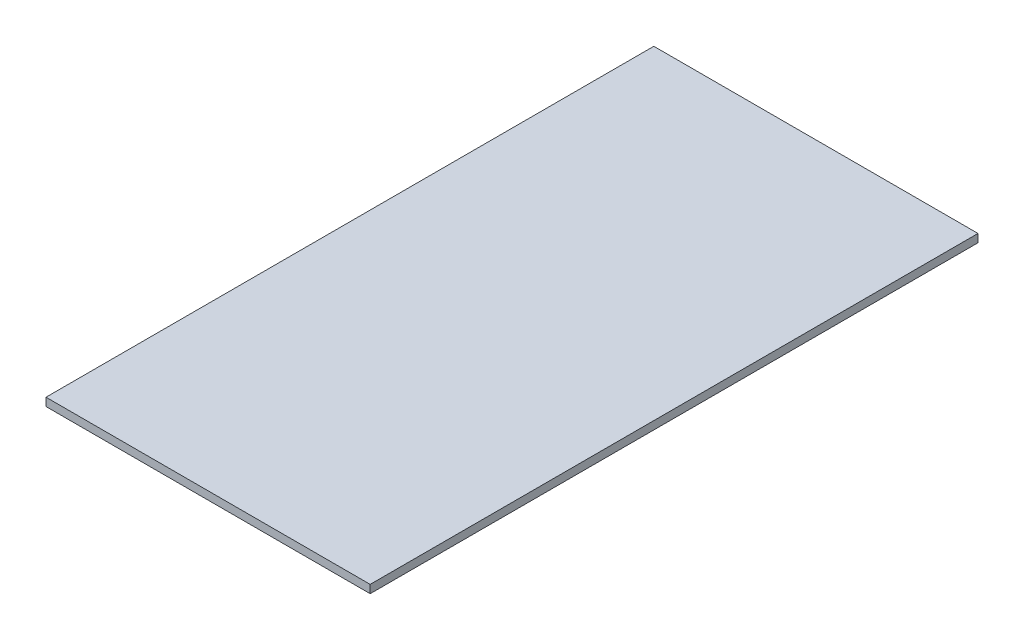
ISO-10303-21;
HEADER;
FILE_DESCRIPTION(('STEP AP214'),'2;1');
FILE_NAME('part.step','',(''),(''),'','','');
FILE_SCHEMA(('AUTOMOTIVE_DESIGN { 1 0 10303 214 1 1 1 1 }'));
ENDSEC;
DATA;
#1=APPLICATION_CONTEXT('core data for automotive mechanical design processes');
#2=APPLICATION_PROTOCOL_DEFINITION('international standard','automotive_design',2000,#1);
#3=PRODUCT_CONTEXT('',#1,'mechanical');
#4=PRODUCT('Part','Part','',(#3));
#5=PRODUCT_RELATED_PRODUCT_CATEGORY('part','',(#4));
#6=PRODUCT_DEFINITION_FORMATION('','',#4);
#7=PRODUCT_DEFINITION_CONTEXT('part definition',#1,'design');
#8=PRODUCT_DEFINITION('design','',#6,#7);
#9=PRODUCT_DEFINITION_SHAPE('','',#8);
#10=(LENGTH_UNIT() NAMED_UNIT(*) SI_UNIT(.MILLI.,.METRE.));
#11=(NAMED_UNIT(*) PLANE_ANGLE_UNIT() SI_UNIT($,.RADIAN.));
#12=(NAMED_UNIT(*) SI_UNIT($,.STERADIAN.) SOLID_ANGLE_UNIT());
#13=UNCERTAINTY_MEASURE_WITH_UNIT(LENGTH_MEASURE(1.E-05),#10,'distance_accuracy_value','');
#14=(GEOMETRIC_REPRESENTATION_CONTEXT(3) GLOBAL_UNCERTAINTY_ASSIGNED_CONTEXT((#13)) GLOBAL_UNIT_ASSIGNED_CONTEXT((#10,
#11,#12)) REPRESENTATION_CONTEXT('',''));
#15=CARTESIAN_POINT('',(0.,0.,0.));
#16=DIRECTION('',(0.,0.,1.));
#17=DIRECTION('',(1.,0.,0.));
#18=AXIS2_PLACEMENT_3D('',#15,#16,#17);
#19=CARTESIAN_POINT('',(200.,5.,375.));
#20=DIRECTION('',(1.,0.,0.));
#21=DIRECTION('',(0.,0.,-1.));
#22=AXIS2_PLACEMENT_3D('',#19,#20,#21);
#23=PLANE('',#22);
#24=DIRECTION('',(0.,1.,0.));
#25=VECTOR('',#24,1.);
#26=CARTESIAN_POINT('',(200.,5.,375.));
#27=LINE('',#26,#25);
#28=CARTESIAN_POINT('',(200.,-5.,375.));
#29=VERTEX_POINT('',#28);
#30=CARTESIAN_POINT('',(200.,5.,375.));
#31=VERTEX_POINT('',#30);
#32=EDGE_CURVE('E11',#29,#31,#27,.T.);
#33=ORIENTED_EDGE('',*,*,#32,.F.);
#34=DIRECTION('',(0.,0.,1.));
#35=VECTOR('',#34,1.);
#36=CARTESIAN_POINT('',(200.,-5.,0.));
#37=LINE('',#36,#35);
#38=CARTESIAN_POINT('',(200.,-5.,-375.));
#39=VERTEX_POINT('',#38);
#40=EDGE_CURVE('E91',#29,#39,#37,.F.);
#41=ORIENTED_EDGE('',*,*,#40,.T.);
#42=DIRECTION('',(0.,1.,0.));
#43=VECTOR('',#42,1.);
#44=CARTESIAN_POINT('',(200.,5.,-375.));
#45=LINE('',#44,#43);
#46=CARTESIAN_POINT('',(200.,5.,-375.));
#47=VERTEX_POINT('',#46);
#48=EDGE_CURVE('E47',#39,#47,#45,.T.);
#49=ORIENTED_EDGE('',*,*,#48,.T.);
#50=DIRECTION('',(0.,0.,-1.));
#51=VECTOR('',#50,1.);
#52=CARTESIAN_POINT('',(200.,5.,375.));
#53=LINE('',#52,#51);
#54=EDGE_CURVE('E104',#31,#47,#53,.T.);
#55=ORIENTED_EDGE('',*,*,#54,.F.);
#56=EDGE_LOOP('',(#33,#41,#49,#55));
#57=FACE_BOUND('',#56,.T.);
#58=ADVANCED_FACE('F37',(#57),#23,.T.);
#59=CARTESIAN_POINT('',(200.,5.,-375.));
#60=DIRECTION('',(0.,0.,-1.));
#61=DIRECTION('',(-1.,0.,0.));
#62=AXIS2_PLACEMENT_3D('',#59,#60,#61);
#63=PLANE('',#62);
#64=ORIENTED_EDGE('',*,*,#48,.F.);
#65=DIRECTION('',(1.,0.,0.));
#66=VECTOR('',#65,1.);
#67=CARTESIAN_POINT('',(0.,-5.,-375.));
#68=LINE('',#67,#66);
#69=CARTESIAN_POINT('',(-200.,-5.,-375.));
#70=VERTEX_POINT('',#69);
#71=EDGE_CURVE('E98',#39,#70,#68,.F.);
#72=ORIENTED_EDGE('',*,*,#71,.T.);
#73=DIRECTION('',(0.,1.,0.));
#74=VECTOR('',#73,1.);
#75=CARTESIAN_POINT('',(-200.,5.,-375.));
#76=LINE('',#75,#74);
#77=CARTESIAN_POINT('',(-200.,5.,-375.));
#78=VERTEX_POINT('',#77);
#79=EDGE_CURVE('E55',#70,#78,#76,.T.);
#80=ORIENTED_EDGE('',*,*,#79,.T.);
#81=DIRECTION('',(-1.,0.,0.));
#82=VECTOR('',#81,1.);
#83=CARTESIAN_POINT('',(200.,5.,-375.));
#84=LINE('',#83,#82);
#85=EDGE_CURVE('E85',#47,#78,#84,.T.);
#86=ORIENTED_EDGE('',*,*,#85,.F.);
#87=EDGE_LOOP('',(#64,#72,#80,#86));
#88=FACE_BOUND('',#87,.T.);
#89=ADVANCED_FACE('F108',(#88),#63,.T.);
#90=CARTESIAN_POINT('',(-200.,5.,375.));
#91=DIRECTION('',(-1.,0.,0.));
#92=DIRECTION('',(0.,0.,1.));
#93=AXIS2_PLACEMENT_3D('',#90,#91,#92);
#94=PLANE('',#93);
#95=ORIENTED_EDGE('',*,*,#79,.F.);
#96=DIRECTION('',(0.,0.,1.));
#97=VECTOR('',#96,1.);
#98=CARTESIAN_POINT('',(-200.,-5.,0.));
#99=LINE('',#98,#97);
#100=CARTESIAN_POINT('',(-200.,-5.,375.));
#101=VERTEX_POINT('',#100);
#102=EDGE_CURVE('E90',#70,#101,#99,.T.);
#103=ORIENTED_EDGE('',*,*,#102,.T.);
#104=DIRECTION('',(0.,1.,0.));
#105=VECTOR('',#104,1.);
#106=CARTESIAN_POINT('',(-200.,5.,375.));
#107=LINE('',#106,#105);
#108=CARTESIAN_POINT('',(-200.,5.,375.));
#109=VERTEX_POINT('',#108);
#110=EDGE_CURVE('E41',#101,#109,#107,.T.);
#111=ORIENTED_EDGE('',*,*,#110,.T.);
#112=DIRECTION('',(0.,0.,1.));
#113=VECTOR('',#112,1.);
#114=CARTESIAN_POINT('',(-200.,5.,375.));
#115=LINE('',#114,#113);
#116=EDGE_CURVE('E100',#78,#109,#115,.T.);
#117=ORIENTED_EDGE('',*,*,#116,.F.);
#118=EDGE_LOOP('',(#95,#103,#111,#117));
#119=FACE_BOUND('',#118,.T.);
#120=ADVANCED_FACE('F93',(#119),#94,.T.);
#121=CARTESIAN_POINT('',(200.,5.,375.));
#122=DIRECTION('',(0.,0.,1.));
#123=DIRECTION('',(1.,0.,0.));
#124=AXIS2_PLACEMENT_3D('',#121,#122,#123);
#125=PLANE('',#124);
#126=DIRECTION('',(1.,0.,0.));
#127=VECTOR('',#126,1.);
#128=CARTESIAN_POINT('',(0.,-5.,375.));
#129=LINE('',#128,#127);
#130=EDGE_CURVE('E79',#101,#29,#129,.T.);
#131=ORIENTED_EDGE('',*,*,#130,.T.);
#132=ORIENTED_EDGE('',*,*,#32,.T.);
#133=DIRECTION('',(1.,0.,0.));
#134=VECTOR('',#133,1.);
#135=CARTESIAN_POINT('',(200.,5.,375.));
#136=LINE('',#135,#134);
#137=EDGE_CURVE('E81',#109,#31,#136,.T.);
#138=ORIENTED_EDGE('',*,*,#137,.F.);
#139=ORIENTED_EDGE('',*,*,#110,.F.);
#140=EDGE_LOOP('',(#131,#132,#138,#139));
#141=FACE_BOUND('',#140,.T.);
#142=ADVANCED_FACE('F39',(#141),#125,.T.);
#143=CARTESIAN_POINT('',(0.,5.,0.));
#144=DIRECTION('',(0.,1.,0.));
#145=DIRECTION('',(0.,0.,1.));
#146=AXIS2_PLACEMENT_3D('',#143,#144,#145);
#147=PLANE('',#146);
#148=ORIENTED_EDGE('',*,*,#116,.T.);
#149=ORIENTED_EDGE('',*,*,#137,.T.);
#150=ORIENTED_EDGE('',*,*,#54,.T.);
#151=ORIENTED_EDGE('',*,*,#85,.T.);
#152=EDGE_LOOP('',(#148,#149,#150,#151));
#153=FACE_BOUND('',#152,.T.);
#154=ADVANCED_FACE('F107',(#153),#147,.T.);
#155=CARTESIAN_POINT('',(0.,-5.,0.));
#156=DIRECTION('',(0.,1.,0.));
#157=DIRECTION('',(0.,0.,1.));
#158=AXIS2_PLACEMENT_3D('',#155,#156,#157);
#159=PLANE('',#158);
#160=ORIENTED_EDGE('',*,*,#102,.F.);
#161=ORIENTED_EDGE('',*,*,#71,.F.);
#162=ORIENTED_EDGE('',*,*,#40,.F.);
#163=ORIENTED_EDGE('',*,*,#130,.F.);
#164=EDGE_LOOP('',(#160,#161,#162,#163));
#165=FACE_BOUND('',#164,.T.);
#166=ADVANCED_FACE('F88',(#165),#159,.F.);
#167=CLOSED_SHELL('',(#58,#89,#120,#142,#154,#166));
#168=MANIFOLD_SOLID_BREP('B2',#167);
#169=ADVANCED_BREP_SHAPE_REPRESENTATION('',(#18,#168),#14);
#170=SHAPE_DEFINITION_REPRESENTATION(#9,#169);
ENDSEC;
END-ISO-10303-21;
